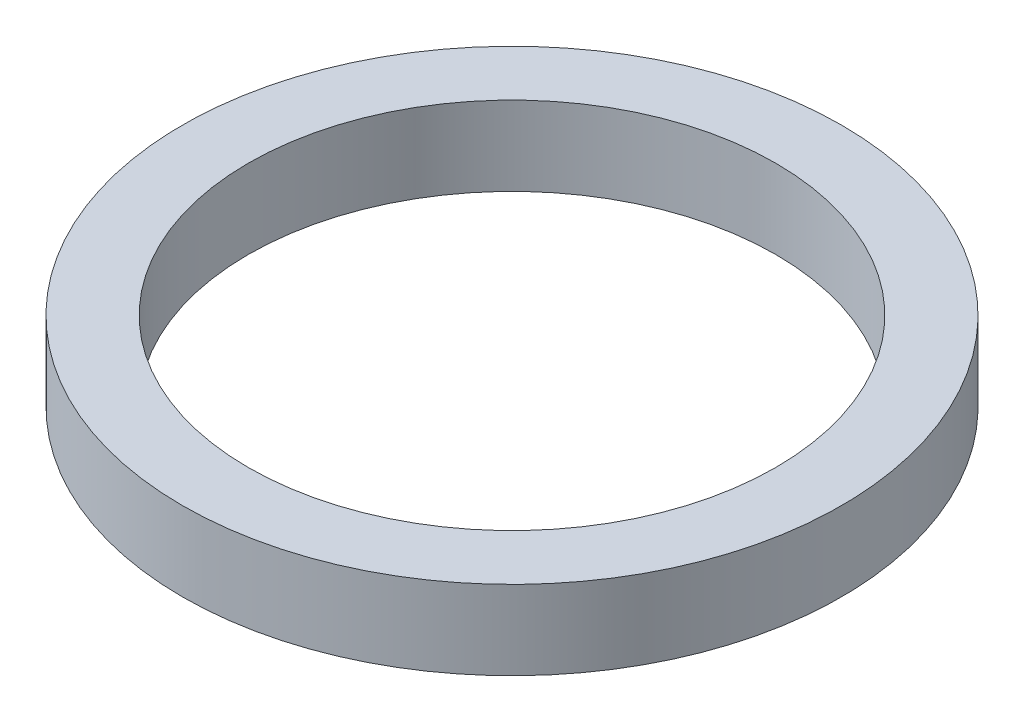
ISO-10303-21;
HEADER;
FILE_DESCRIPTION(('STEP AP214'),'2;1');
FILE_NAME('part.step','',(''),(''),'','','');
FILE_SCHEMA(('AUTOMOTIVE_DESIGN { 1 0 10303 214 1 1 1 1 }'));
ENDSEC;
DATA;
#1=APPLICATION_CONTEXT('core data for automotive mechanical design processes');
#2=APPLICATION_PROTOCOL_DEFINITION('international standard','automotive_design',2000,#1);
#3=PRODUCT_CONTEXT('',#1,'mechanical');
#4=PRODUCT('Part','Part','',(#3));
#5=PRODUCT_RELATED_PRODUCT_CATEGORY('part','',(#4));
#6=PRODUCT_DEFINITION_FORMATION('','',#4);
#7=PRODUCT_DEFINITION_CONTEXT('part definition',#1,'design');
#8=PRODUCT_DEFINITION('design','',#6,#7);
#9=PRODUCT_DEFINITION_SHAPE('','',#8);
#10=(LENGTH_UNIT() NAMED_UNIT(*) SI_UNIT(.MILLI.,.METRE.));
#11=(NAMED_UNIT(*) PLANE_ANGLE_UNIT() SI_UNIT($,.RADIAN.));
#12=(NAMED_UNIT(*) SI_UNIT($,.STERADIAN.) SOLID_ANGLE_UNIT());
#13=UNCERTAINTY_MEASURE_WITH_UNIT(LENGTH_MEASURE(1.E-05),#10,'distance_accuracy_value','');
#14=(GEOMETRIC_REPRESENTATION_CONTEXT(3) GLOBAL_UNCERTAINTY_ASSIGNED_CONTEXT((#13)) GLOBAL_UNIT_ASSIGNED_CONTEXT((#10,
#11,#12)) REPRESENTATION_CONTEXT('',''));
#15=CARTESIAN_POINT('',(0.,0.,0.));
#16=DIRECTION('',(0.,0.,1.));
#17=DIRECTION('',(1.,0.,0.));
#18=AXIS2_PLACEMENT_3D('',#15,#16,#17);
#19=CARTESIAN_POINT('',(0.,9.,0.));
#20=DIRECTION('',(0.,-1.,0.));
#21=DIRECTION('',(0.,0.,-1.));
#22=AXIS2_PLACEMENT_3D('',#19,#20,#21);
#23=CYLINDRICAL_SURFACE('',#22,37.5);
#24=CARTESIAN_POINT('',(0.,9.,0.));
#25=DIRECTION('',(0.,1.,0.));
#26=DIRECTION('',(0.,0.,1.));
#27=AXIS2_PLACEMENT_3D('',#24,#25,#26);
#28=CIRCLE('',#27,37.5);
#29=CARTESIAN_POINT('',(0.,9.,37.5));
#30=VERTEX_POINT('',#29);
#31=EDGE_CURVE('E10',#30,#30,#28,.T.);
#32=ORIENTED_EDGE('',*,*,#31,.F.);
#33=EDGE_LOOP('',(#32));
#34=FACE_BOUND('',#33,.T.);
#35=CARTESIAN_POINT('',(0.,0.,0.));
#36=DIRECTION('',(0.,1.,0.));
#37=DIRECTION('',(0.,0.,1.));
#38=AXIS2_PLACEMENT_3D('',#35,#36,#37);
#39=CIRCLE('',#38,37.5);
#40=CARTESIAN_POINT('',(0.,0.,37.5));
#41=VERTEX_POINT('',#40);
#42=EDGE_CURVE('E37',#41,#41,#39,.T.);
#43=ORIENTED_EDGE('',*,*,#42,.T.);
#44=EDGE_LOOP('',(#43));
#45=FACE_BOUND('',#44,.T.);
#46=ADVANCED_FACE('F40',(#34,#45),#23,.T.);
#47=CARTESIAN_POINT('',(0.,9.,0.));
#48=DIRECTION('',(0.,1.,0.));
#49=DIRECTION('',(0.,0.,1.));
#50=AXIS2_PLACEMENT_3D('',#47,#48,#49);
#51=PLANE('',#50);
#52=CARTESIAN_POINT('',(0.,9.,0.));
#53=DIRECTION('',(0.,1.,0.));
#54=DIRECTION('',(0.,0.,1.));
#55=AXIS2_PLACEMENT_3D('',#52,#53,#54);
#56=CIRCLE('',#55,30.);
#57=CARTESIAN_POINT('',(0.,9.,30.));
#58=VERTEX_POINT('',#57);
#59=EDGE_CURVE('E50',#58,#58,#56,.T.);
#60=ORIENTED_EDGE('',*,*,#59,.F.);
#61=EDGE_LOOP('',(#60));
#62=FACE_BOUND('',#61,.T.);
#63=ORIENTED_EDGE('',*,*,#31,.T.);
#64=EDGE_LOOP('',(#63));
#65=FACE_BOUND('',#64,.T.);
#66=ADVANCED_FACE('F59',(#62,#65),#51,.T.);
#67=CARTESIAN_POINT('',(0.,0.,0.));
#68=DIRECTION('',(0.,1.,0.));
#69=DIRECTION('',(0.,0.,1.));
#70=AXIS2_PLACEMENT_3D('',#67,#68,#69);
#71=PLANE('',#70);
#72=CARTESIAN_POINT('',(0.,0.,0.));
#73=DIRECTION('',(0.,1.,0.));
#74=DIRECTION('',(0.,0.,1.));
#75=AXIS2_PLACEMENT_3D('',#72,#73,#74);
#76=CIRCLE('',#75,30.);
#77=CARTESIAN_POINT('',(0.,0.,30.));
#78=VERTEX_POINT('',#77);
#79=EDGE_CURVE('E47',#78,#78,#76,.T.);
#80=ORIENTED_EDGE('',*,*,#79,.T.);
#81=EDGE_LOOP('',(#80));
#82=FACE_BOUND('',#81,.T.);
#83=ORIENTED_EDGE('',*,*,#42,.F.);
#84=EDGE_LOOP('',(#83));
#85=FACE_BOUND('',#84,.T.);
#86=ADVANCED_FACE('F58',(#82,#85),#71,.F.);
#87=CARTESIAN_POINT('',(0.,9.,0.));
#88=DIRECTION('',(0.,-1.,0.));
#89=DIRECTION('',(0.,0.,-1.));
#90=AXIS2_PLACEMENT_3D('',#87,#88,#89);
#91=CYLINDRICAL_SURFACE('',#90,30.);
#92=ORIENTED_EDGE('',*,*,#59,.T.);
#93=EDGE_LOOP('',(#92));
#94=FACE_BOUND('',#93,.T.);
#95=ORIENTED_EDGE('',*,*,#79,.F.);
#96=EDGE_LOOP('',(#95));
#97=FACE_BOUND('',#96,.T.);
#98=ADVANCED_FACE('F54',(#94,#97),#91,.F.);
#99=CLOSED_SHELL('',(#46,#66,#86,#98));
#100=MANIFOLD_SOLID_BREP('B2',#99);
#101=ADVANCED_BREP_SHAPE_REPRESENTATION('',(#18,#100),#14);
#102=SHAPE_DEFINITION_REPRESENTATION(#9,#101);
ENDSEC;
END-ISO-10303-21;
